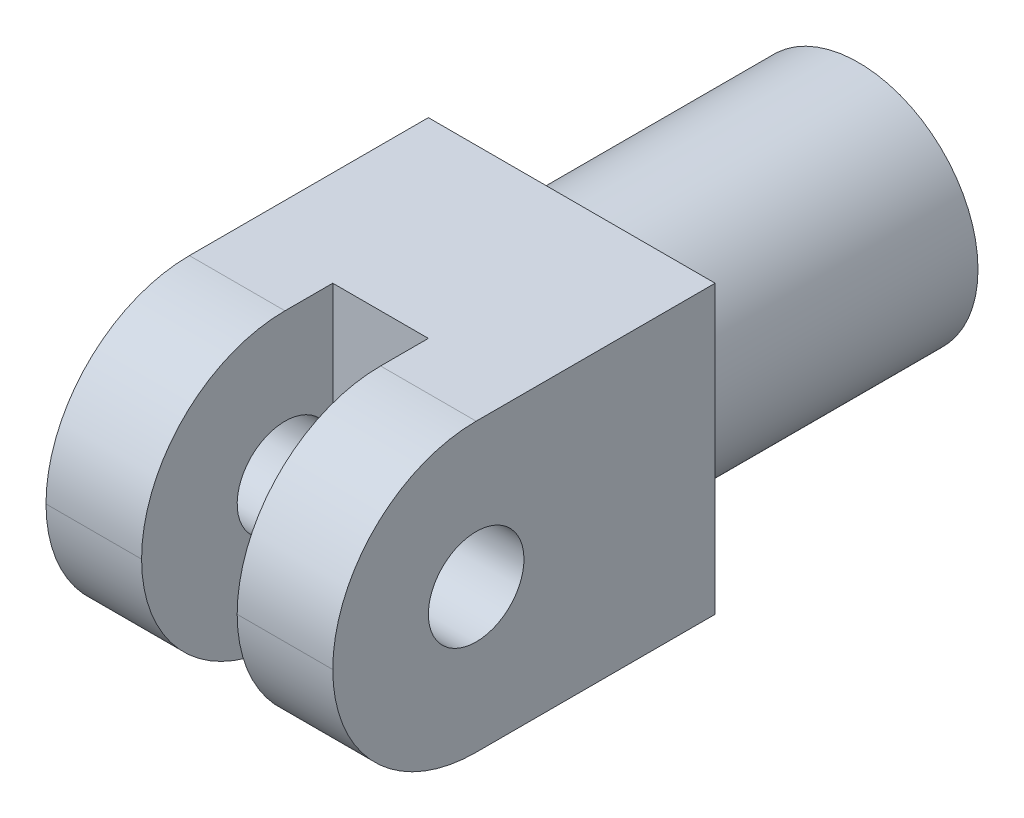
ISO-10303-21;
HEADER;
FILE_DESCRIPTION(('STEP AP214'),'2;1');
FILE_NAME('part.step','',(''),(''),'','','');
FILE_SCHEMA(('AUTOMOTIVE_DESIGN { 1 0 10303 214 1 1 1 1 }'));
ENDSEC;
DATA;
#1=APPLICATION_CONTEXT('core data for automotive mechanical design processes');
#2=APPLICATION_PROTOCOL_DEFINITION('international standard','automotive_design',2000,#1);
#3=PRODUCT_CONTEXT('',#1,'mechanical');
#4=PRODUCT('Part','Part','',(#3));
#5=PRODUCT_RELATED_PRODUCT_CATEGORY('part','',(#4));
#6=PRODUCT_DEFINITION_FORMATION('','',#4);
#7=PRODUCT_DEFINITION_CONTEXT('part definition',#1,'design');
#8=PRODUCT_DEFINITION('design','',#6,#7);
#9=PRODUCT_DEFINITION_SHAPE('','',#8);
#10=(LENGTH_UNIT() NAMED_UNIT(*) SI_UNIT(.MILLI.,.METRE.));
#11=(NAMED_UNIT(*) PLANE_ANGLE_UNIT() SI_UNIT($,.RADIAN.));
#12=(NAMED_UNIT(*) SI_UNIT($,.STERADIAN.) SOLID_ANGLE_UNIT());
#13=UNCERTAINTY_MEASURE_WITH_UNIT(LENGTH_MEASURE(1.E-05),#10,'distance_accuracy_value','');
#14=(GEOMETRIC_REPRESENTATION_CONTEXT(3) GLOBAL_UNCERTAINTY_ASSIGNED_CONTEXT((#13)) GLOBAL_UNIT_ASSIGNED_CONTEXT((#10,
#11,#12)) REPRESENTATION_CONTEXT('',''));
#15=CARTESIAN_POINT('',(0.,0.,0.));
#16=DIRECTION('',(0.,0.,1.));
#17=DIRECTION('',(1.,0.,0.));
#18=AXIS2_PLACEMENT_3D('',#15,#16,#17);
#19=CARTESIAN_POINT('',(0.,0.,30.));
#20=DIRECTION('',(0.,0.,-1.));
#21=DIRECTION('',(-1.,0.,0.));
#22=AXIS2_PLACEMENT_3D('',#19,#20,#21);
#23=CYLINDRICAL_SURFACE('',#22,12.5);
#24=CARTESIAN_POINT('',(0.,0.,30.));
#25=DIRECTION('',(0.,0.,1.));
#26=DIRECTION('',(1.,0.,0.));
#27=AXIS2_PLACEMENT_3D('',#24,#25,#26);
#28=CIRCLE('',#27,12.5);
#29=CARTESIAN_POINT('',(12.5,0.,30.));
#30=VERTEX_POINT('',#29);
#31=EDGE_CURVE('E174',#30,#30,#28,.T.);
#32=ORIENTED_EDGE('',*,*,#31,.F.);
#33=EDGE_LOOP('',(#32));
#34=FACE_BOUND('',#33,.T.);
#35=CARTESIAN_POINT('',(0.,0.,0.));
#36=DIRECTION('',(0.,0.,1.));
#37=DIRECTION('',(1.,0.,0.));
#38=AXIS2_PLACEMENT_3D('',#35,#36,#37);
#39=CIRCLE('',#38,12.5);
#40=CARTESIAN_POINT('',(12.5,0.,0.));
#41=VERTEX_POINT('',#40);
#42=EDGE_CURVE('E173',#41,#41,#39,.T.);
#43=ORIENTED_EDGE('',*,*,#42,.T.);
#44=EDGE_LOOP('',(#43));
#45=FACE_BOUND('',#44,.T.);
#46=ADVANCED_FACE('F33',(#34,#45),#23,.T.);
#47=CARTESIAN_POINT('',(0.,0.,0.));
#48=DIRECTION('',(0.,0.,1.));
#49=DIRECTION('',(1.,0.,0.));
#50=AXIS2_PLACEMENT_3D('',#47,#48,#49);
#51=PLANE('',#50);
#52=ORIENTED_EDGE('',*,*,#42,.F.);
#53=EDGE_LOOP('',(#52));
#54=FACE_BOUND('',#53,.T.);
#55=ADVANCED_FACE('F263',(#54),#51,.F.);
#56=CARTESIAN_POINT('',(15.,15.,70.));
#57=DIRECTION('',(-1.,0.,0.));
#58=DIRECTION('',(0.,-1.,0.));
#59=AXIS2_PLACEMENT_3D('',#56,#57,#58);
#60=PLANE('',#59);
#61=CARTESIAN_POINT('',(15.,0.,55.));
#62=DIRECTION('',(-1.,0.,0.));
#63=DIRECTION('',(0.,-1.,0.));
#64=AXIS2_PLACEMENT_3D('',#61,#62,#63);
#65=CIRCLE('',#64,5.);
#66=CARTESIAN_POINT('',(15.,-4.99999999999999,55.));
#67=VERTEX_POINT('',#66);
#68=EDGE_CURVE('E206',#67,#67,#65,.T.);
#69=ORIENTED_EDGE('',*,*,#68,.T.);
#70=EDGE_LOOP('',(#69));
#71=FACE_BOUND('',#70,.T.);
#72=DIRECTION('',(0.,0.,-1.));
#73=VECTOR('',#72,1.);
#74=CARTESIAN_POINT('',(15.,15.,70.));
#75=LINE('',#74,#73);
#76=CARTESIAN_POINT('',(15.,15.,55.));
#77=VERTEX_POINT('',#76);
#78=CARTESIAN_POINT('',(15.,15.,30.));
#79=VERTEX_POINT('',#78);
#80=EDGE_CURVE('E171',#77,#79,#75,.T.);
#81=ORIENTED_EDGE('',*,*,#80,.F.);
#82=CARTESIAN_POINT('',(15.,0.,55.));
#83=DIRECTION('',(-1.,0.,0.));
#84=DIRECTION('',(0.,-1.,0.));
#85=AXIS2_PLACEMENT_3D('',#82,#83,#84);
#86=CIRCLE('',#85,15.);
#87=CARTESIAN_POINT('',(15.,0.,70.));
#88=VERTEX_POINT('',#87);
#89=EDGE_CURVE('E191',#77,#88,#86,.F.);
#90=ORIENTED_EDGE('',*,*,#89,.T.);
#91=CARTESIAN_POINT('',(15.,0.,55.));
#92=DIRECTION('',(-1.,0.,0.));
#93=DIRECTION('',(0.,-1.,0.));
#94=AXIS2_PLACEMENT_3D('',#91,#92,#93);
#95=CIRCLE('',#94,15.);
#96=CARTESIAN_POINT('',(15.,-15.,55.));
#97=VERTEX_POINT('',#96);
#98=EDGE_CURVE('E189',#88,#97,#95,.F.);
#99=ORIENTED_EDGE('',*,*,#98,.T.);
#100=DIRECTION('',(0.,0.,-1.));
#101=VECTOR('',#100,1.);
#102=CARTESIAN_POINT('',(15.,-15.,70.));
#103=LINE('',#102,#101);
#104=CARTESIAN_POINT('',(15.,-15.,30.));
#105=VERTEX_POINT('',#104);
#106=EDGE_CURVE('E165',#97,#105,#103,.T.);
#107=ORIENTED_EDGE('',*,*,#106,.T.);
#108=DIRECTION('',(0.,1.,0.));
#109=VECTOR('',#108,1.);
#110=CARTESIAN_POINT('',(15.,15.,30.));
#111=LINE('',#110,#109);
#112=EDGE_CURVE('E153',#105,#79,#111,.T.);
#113=ORIENTED_EDGE('',*,*,#112,.T.);
#114=EDGE_LOOP('',(#81,#90,#99,#107,#113));
#115=FACE_BOUND('',#114,.T.);
#116=ADVANCED_FACE('F232',(#71,#115),#60,.F.);
#117=CARTESIAN_POINT('',(-15.,15.,70.));
#118=DIRECTION('',(0.,-1.,0.));
#119=DIRECTION('',(0.,0.,-1.));
#120=AXIS2_PLACEMENT_3D('',#117,#118,#119);
#121=PLANE('',#120);
#122=DIRECTION('',(0.,0.,-1.));
#123=VECTOR('',#122,1.);
#124=CARTESIAN_POINT('',(5.,15.,70.));
#125=LINE('',#124,#123);
#126=CARTESIAN_POINT('',(5.,15.,55.));
#127=VERTEX_POINT('',#126);
#128=CARTESIAN_POINT('',(5.,15.,50.));
#129=VERTEX_POINT('',#128);
#130=EDGE_CURVE('E129',#127,#129,#125,.T.);
#131=ORIENTED_EDGE('',*,*,#130,.F.);
#132=DIRECTION('',(-1.,0.,0.));
#133=VECTOR('',#132,1.);
#134=CARTESIAN_POINT('',(15.,15.,55.));
#135=LINE('',#134,#133);
#136=EDGE_CURVE('E187',#127,#77,#135,.F.);
#137=ORIENTED_EDGE('',*,*,#136,.T.);
#138=ORIENTED_EDGE('',*,*,#80,.T.);
#139=DIRECTION('',(-1.,0.,0.));
#140=VECTOR('',#139,1.);
#141=CARTESIAN_POINT('',(-15.,15.,30.));
#142=LINE('',#141,#140);
#143=CARTESIAN_POINT('',(-15.,15.,30.));
#144=VERTEX_POINT('',#143);
#145=EDGE_CURVE('E156',#79,#144,#142,.T.);
#146=ORIENTED_EDGE('',*,*,#145,.T.);
#147=DIRECTION('',(0.,0.,-1.));
#148=VECTOR('',#147,1.);
#149=CARTESIAN_POINT('',(-15.,15.,70.));
#150=LINE('',#149,#148);
#151=CARTESIAN_POINT('',(-15.,15.,55.));
#152=VERTEX_POINT('',#151);
#153=EDGE_CURVE('E169',#152,#144,#150,.T.);
#154=ORIENTED_EDGE('',*,*,#153,.F.);
#155=DIRECTION('',(-1.,0.,0.));
#156=VECTOR('',#155,1.);
#157=CARTESIAN_POINT('',(-4.99999999999999,15.,55.));
#158=LINE('',#157,#156);
#159=CARTESIAN_POINT('',(-5.,15.,55.));
#160=VERTEX_POINT('',#159);
#161=EDGE_CURVE('E185',#152,#160,#158,.F.);
#162=ORIENTED_EDGE('',*,*,#161,.T.);
#163=DIRECTION('',(0.,0.,1.));
#164=VECTOR('',#163,1.);
#165=CARTESIAN_POINT('',(-5.,15.,50.));
#166=LINE('',#165,#164);
#167=CARTESIAN_POINT('',(-5.,15.,50.));
#168=VERTEX_POINT('',#167);
#169=EDGE_CURVE('E126',#168,#160,#166,.T.);
#170=ORIENTED_EDGE('',*,*,#169,.F.);
#171=DIRECTION('',(-1.,0.,0.));
#172=VECTOR('',#171,1.);
#173=CARTESIAN_POINT('',(5.,15.,50.));
#174=LINE('',#173,#172);
#175=EDGE_CURVE('E120',#129,#168,#174,.T.);
#176=ORIENTED_EDGE('',*,*,#175,.F.);
#177=EDGE_LOOP('',(#131,#137,#138,#146,#154,#162,#170,#176));
#178=FACE_BOUND('',#177,.T.);
#179=ADVANCED_FACE('F138',(#178),#121,.F.);
#180=CARTESIAN_POINT('',(-15.,15.,70.));
#181=DIRECTION('',(1.,0.,0.));
#182=DIRECTION('',(0.,1.,0.));
#183=AXIS2_PLACEMENT_3D('',#180,#181,#182);
#184=PLANE('',#183);
#185=CARTESIAN_POINT('',(-15.,0.,55.));
#186=DIRECTION('',(-1.,0.,0.));
#187=DIRECTION('',(0.,-1.,0.));
#188=AXIS2_PLACEMENT_3D('',#185,#186,#187);
#189=CIRCLE('',#188,5.);
#190=CARTESIAN_POINT('',(-15.,-5.,55.));
#191=VERTEX_POINT('',#190);
#192=EDGE_CURVE('E215',#191,#191,#189,.T.);
#193=ORIENTED_EDGE('',*,*,#192,.F.);
#194=EDGE_LOOP('',(#193));
#195=FACE_BOUND('',#194,.T.);
#196=DIRECTION('',(0.,0.,-1.));
#197=VECTOR('',#196,1.);
#198=CARTESIAN_POINT('',(-15.,-15.,70.));
#199=LINE('',#198,#197);
#200=CARTESIAN_POINT('',(-15.,-15.,55.));
#201=VERTEX_POINT('',#200);
#202=CARTESIAN_POINT('',(-15.,-15.,30.));
#203=VERTEX_POINT('',#202);
#204=EDGE_CURVE('E167',#201,#203,#199,.T.);
#205=ORIENTED_EDGE('',*,*,#204,.F.);
#206=CARTESIAN_POINT('',(-15.,0.,55.));
#207=DIRECTION('',(1.,0.,0.));
#208=DIRECTION('',(0.,1.,0.));
#209=AXIS2_PLACEMENT_3D('',#206,#207,#208);
#210=CIRCLE('',#209,15.);
#211=CARTESIAN_POINT('',(-15.,0.,70.));
#212=VERTEX_POINT('',#211);
#213=EDGE_CURVE('E11',#201,#212,#210,.F.);
#214=ORIENTED_EDGE('',*,*,#213,.T.);
#215=CARTESIAN_POINT('',(-15.,0.,55.));
#216=DIRECTION('',(1.,0.,0.));
#217=DIRECTION('',(0.,1.,0.));
#218=AXIS2_PLACEMENT_3D('',#215,#216,#217);
#219=CIRCLE('',#218,15.);
#220=EDGE_CURVE('E42',#212,#152,#219,.F.);
#221=ORIENTED_EDGE('',*,*,#220,.T.);
#222=ORIENTED_EDGE('',*,*,#153,.T.);
#223=DIRECTION('',(0.,-1.,0.));
#224=VECTOR('',#223,1.);
#225=CARTESIAN_POINT('',(-15.,15.,30.));
#226=LINE('',#225,#224);
#227=EDGE_CURVE('E159',#144,#203,#226,.T.);
#228=ORIENTED_EDGE('',*,*,#227,.T.);
#229=EDGE_LOOP('',(#205,#214,#221,#222,#228));
#230=FACE_BOUND('',#229,.T.);
#231=ADVANCED_FACE('F252',(#195,#230),#184,.F.);
#232=CARTESIAN_POINT('',(-15.,-15.,70.));
#233=DIRECTION('',(0.,1.,0.));
#234=DIRECTION('',(0.,0.,1.));
#235=AXIS2_PLACEMENT_3D('',#232,#233,#234);
#236=PLANE('',#235);
#237=ORIENTED_EDGE('',*,*,#106,.F.);
#238=DIRECTION('',(1.,0.,0.));
#239=VECTOR('',#238,1.);
#240=CARTESIAN_POINT('',(5.,-15.,55.));
#241=LINE('',#240,#239);
#242=CARTESIAN_POINT('',(5.,-15.,55.));
#243=VERTEX_POINT('',#242);
#244=EDGE_CURVE('E196',#97,#243,#241,.F.);
#245=ORIENTED_EDGE('',*,*,#244,.T.);
#246=DIRECTION('',(0.,0.,-1.));
#247=VECTOR('',#246,1.);
#248=CARTESIAN_POINT('',(5.,-15.,70.));
#249=LINE('',#248,#247);
#250=CARTESIAN_POINT('',(5.,-15.,50.));
#251=VERTEX_POINT('',#250);
#252=EDGE_CURVE('E146',#243,#251,#249,.T.);
#253=ORIENTED_EDGE('',*,*,#252,.T.);
#254=DIRECTION('',(-1.,0.,0.));
#255=VECTOR('',#254,1.);
#256=CARTESIAN_POINT('',(-15.,-15.,50.));
#257=LINE('',#256,#255);
#258=CARTESIAN_POINT('',(-5.,-15.,50.));
#259=VERTEX_POINT('',#258);
#260=EDGE_CURVE('E177',#251,#259,#257,.T.);
#261=ORIENTED_EDGE('',*,*,#260,.T.);
#262=DIRECTION('',(0.,0.,1.));
#263=VECTOR('',#262,1.);
#264=CARTESIAN_POINT('',(-4.99999999999999,-15.,70.));
#265=LINE('',#264,#263);
#266=CARTESIAN_POINT('',(-5.,-15.,55.));
#267=VERTEX_POINT('',#266);
#268=EDGE_CURVE('E150',#259,#267,#265,.T.);
#269=ORIENTED_EDGE('',*,*,#268,.T.);
#270=DIRECTION('',(1.,0.,0.));
#271=VECTOR('',#270,1.);
#272=CARTESIAN_POINT('',(-15.,-15.,55.));
#273=LINE('',#272,#271);
#274=EDGE_CURVE('E193',#267,#201,#273,.F.);
#275=ORIENTED_EDGE('',*,*,#274,.T.);
#276=ORIENTED_EDGE('',*,*,#204,.T.);
#277=DIRECTION('',(1.,0.,0.));
#278=VECTOR('',#277,1.);
#279=CARTESIAN_POINT('',(-15.,-15.,30.));
#280=LINE('',#279,#278);
#281=EDGE_CURVE('E162',#203,#105,#280,.T.);
#282=ORIENTED_EDGE('',*,*,#281,.T.);
#283=EDGE_LOOP('',(#237,#245,#253,#261,#269,#275,#276,#282));
#284=FACE_BOUND('',#283,.T.);
#285=ADVANCED_FACE('F249',(#284),#236,.F.);
#286=CARTESIAN_POINT('',(0.,0.,30.));
#287=DIRECTION('',(0.,0.,1.));
#288=DIRECTION('',(1.,0.,0.));
#289=AXIS2_PLACEMENT_3D('',#286,#287,#288);
#290=PLANE('',#289);
#291=ORIENTED_EDGE('',*,*,#31,.T.);
#292=EDGE_LOOP('',(#291));
#293=FACE_BOUND('',#292,.T.);
#294=ORIENTED_EDGE('',*,*,#112,.F.);
#295=ORIENTED_EDGE('',*,*,#281,.F.);
#296=ORIENTED_EDGE('',*,*,#227,.F.);
#297=ORIENTED_EDGE('',*,*,#145,.F.);
#298=EDGE_LOOP('',(#294,#295,#296,#297));
#299=FACE_BOUND('',#298,.T.);
#300=ADVANCED_FACE('F237',(#293,#299),#290,.F.);
#301=CARTESIAN_POINT('',(5.,-25.,50.));
#302=DIRECTION('',(0.,0.,-1.));
#303=DIRECTION('',(-1.,0.,0.));
#304=AXIS2_PLACEMENT_3D('',#301,#302,#303);
#305=PLANE('',#304);
#306=DIRECTION('',(0.,1.,0.));
#307=VECTOR('',#306,1.);
#308=CARTESIAN_POINT('',(5.,-25.,50.));
#309=LINE('',#308,#307);
#310=CARTESIAN_POINT('',(5.,0.,50.));
#311=VERTEX_POINT('',#310);
#312=EDGE_CURVE('E124',#251,#311,#309,.T.);
#313=ORIENTED_EDGE('',*,*,#312,.T.);
#314=EDGE_CURVE('E115',#311,#129,#309,.T.);
#315=ORIENTED_EDGE('',*,*,#314,.T.);
#316=ORIENTED_EDGE('',*,*,#175,.T.);
#317=DIRECTION('',(0.,1.,0.));
#318=VECTOR('',#317,1.);
#319=CARTESIAN_POINT('',(-5.,-25.,50.));
#320=LINE('',#319,#318);
#321=CARTESIAN_POINT('',(-5.,0.,50.));
#322=VERTEX_POINT('',#321);
#323=EDGE_CURVE('E147',#322,#168,#320,.T.);
#324=ORIENTED_EDGE('',*,*,#323,.F.);
#325=EDGE_CURVE('E144',#259,#322,#320,.T.);
#326=ORIENTED_EDGE('',*,*,#325,.F.);
#327=ORIENTED_EDGE('',*,*,#260,.F.);
#328=EDGE_LOOP('',(#313,#315,#316,#324,#326,#327));
#329=FACE_BOUND('',#328,.T.);
#330=ADVANCED_FACE('F117',(#329),#305,.F.);
#331=CARTESIAN_POINT('',(-5.,-25.,50.));
#332=DIRECTION('',(-1.,0.,0.));
#333=DIRECTION('',(0.,0.,1.));
#334=AXIS2_PLACEMENT_3D('',#331,#332,#333);
#335=PLANE('',#334);
#336=ORIENTED_EDGE('',*,*,#325,.T.);
#337=CARTESIAN_POINT('',(-5.,0.,55.));
#338=DIRECTION('',(-1.,0.,0.));
#339=DIRECTION('',(0.,0.,1.));
#340=AXIS2_PLACEMENT_3D('',#337,#338,#339);
#341=CIRCLE('',#340,5.);
#342=EDGE_CURVE('E48',#322,#322,#341,.T.);
#343=ORIENTED_EDGE('',*,*,#342,.T.);
#344=ORIENTED_EDGE('',*,*,#323,.T.);
#345=ORIENTED_EDGE('',*,*,#169,.T.);
#346=CARTESIAN_POINT('',(-5.,0.,55.));
#347=DIRECTION('',(-1.,0.,0.));
#348=DIRECTION('',(0.,0.,1.));
#349=AXIS2_PLACEMENT_3D('',#346,#347,#348);
#350=CIRCLE('',#349,15.);
#351=CARTESIAN_POINT('',(-4.99999999999999,0.,70.));
#352=VERTEX_POINT('',#351);
#353=EDGE_CURVE('E198',#160,#352,#350,.F.);
#354=ORIENTED_EDGE('',*,*,#353,.T.);
#355=CARTESIAN_POINT('',(-5.,0.,55.));
#356=DIRECTION('',(-1.,0.,0.));
#357=DIRECTION('',(0.,0.,1.));
#358=AXIS2_PLACEMENT_3D('',#355,#356,#357);
#359=CIRCLE('',#358,15.);
#360=EDGE_CURVE('E200',#352,#267,#359,.F.);
#361=ORIENTED_EDGE('',*,*,#360,.T.);
#362=ORIENTED_EDGE('',*,*,#268,.F.);
#363=EDGE_LOOP('',(#336,#343,#344,#345,#354,#361,#362));
#364=FACE_BOUND('',#363,.T.);
#365=ADVANCED_FACE('F246',(#364),#335,.F.);
#366=CARTESIAN_POINT('',(5.,-25.,70.));
#367=DIRECTION('',(1.,0.,0.));
#368=DIRECTION('',(0.,0.,-1.));
#369=AXIS2_PLACEMENT_3D('',#366,#367,#368);
#370=PLANE('',#369);
#371=ORIENTED_EDGE('',*,*,#314,.F.);
#372=CARTESIAN_POINT('',(5.,0.,55.));
#373=DIRECTION('',(1.,0.,0.));
#374=DIRECTION('',(0.,0.,-1.));
#375=AXIS2_PLACEMENT_3D('',#372,#373,#374);
#376=CIRCLE('',#375,5.);
#377=EDGE_CURVE('E37',#311,#311,#376,.T.);
#378=ORIENTED_EDGE('',*,*,#377,.T.);
#379=ORIENTED_EDGE('',*,*,#312,.F.);
#380=ORIENTED_EDGE('',*,*,#252,.F.);
#381=CARTESIAN_POINT('',(5.,0.,55.));
#382=DIRECTION('',(1.,0.,0.));
#383=DIRECTION('',(0.,0.,-1.));
#384=AXIS2_PLACEMENT_3D('',#381,#382,#383);
#385=CIRCLE('',#384,15.);
#386=CARTESIAN_POINT('',(5.,0.,70.));
#387=VERTEX_POINT('',#386);
#388=EDGE_CURVE('E182',#243,#387,#385,.F.);
#389=ORIENTED_EDGE('',*,*,#388,.T.);
#390=CARTESIAN_POINT('',(5.,0.,55.));
#391=DIRECTION('',(1.,0.,0.));
#392=DIRECTION('',(0.,0.,-1.));
#393=AXIS2_PLACEMENT_3D('',#390,#391,#392);
#394=CIRCLE('',#393,15.);
#395=EDGE_CURVE('E132',#387,#127,#394,.F.);
#396=ORIENTED_EDGE('',*,*,#395,.T.);
#397=ORIENTED_EDGE('',*,*,#130,.T.);
#398=EDGE_LOOP('',(#371,#378,#379,#380,#389,#396,#397));
#399=FACE_BOUND('',#398,.T.);
#400=ADVANCED_FACE('F130',(#399),#370,.F.);
#401=CARTESIAN_POINT('',(0.,0.,55.));
#402=DIRECTION('',(-1.,0.,0.));
#403=DIRECTION('',(0.,0.,1.));
#404=AXIS2_PLACEMENT_3D('',#401,#402,#403);
#405=CYLINDRICAL_SURFACE('',#404,15.);
#406=ORIENTED_EDGE('',*,*,#244,.F.);
#407=ORIENTED_EDGE('',*,*,#98,.F.);
#408=DIRECTION('',(1.,0.,0.));
#409=VECTOR('',#408,1.);
#410=CARTESIAN_POINT('',(15.,0.,70.));
#411=LINE('',#410,#409);
#412=EDGE_CURVE('E136',#387,#88,#411,.T.);
#413=ORIENTED_EDGE('',*,*,#412,.F.);
#414=ORIENTED_EDGE('',*,*,#388,.F.);
#415=EDGE_LOOP('',(#406,#407,#413,#414));
#416=FACE_BOUND('',#415,.T.);
#417=ADVANCED_FACE('F225',(#416),#405,.T.);
#418=CARTESIAN_POINT('',(0.,0.,55.));
#419=DIRECTION('',(1.,0.,0.));
#420=DIRECTION('',(0.,0.,-1.));
#421=AXIS2_PLACEMENT_3D('',#418,#419,#420);
#422=CYLINDRICAL_SURFACE('',#421,15.);
#423=ORIENTED_EDGE('',*,*,#89,.F.);
#424=ORIENTED_EDGE('',*,*,#136,.F.);
#425=ORIENTED_EDGE('',*,*,#395,.F.);
#426=ORIENTED_EDGE('',*,*,#412,.T.);
#427=EDGE_LOOP('',(#423,#424,#425,#426));
#428=FACE_BOUND('',#427,.T.);
#429=ADVANCED_FACE('F228',(#428),#422,.T.);
#430=CARTESIAN_POINT('',(0.,0.,55.));
#431=DIRECTION('',(1.,0.,0.));
#432=DIRECTION('',(0.,0.,-1.));
#433=AXIS2_PLACEMENT_3D('',#430,#431,#432);
#434=CYLINDRICAL_SURFACE('',#433,15.);
#435=ORIENTED_EDGE('',*,*,#161,.F.);
#436=ORIENTED_EDGE('',*,*,#220,.F.);
#437=DIRECTION('',(-1.,0.,0.));
#438=VECTOR('',#437,1.);
#439=CARTESIAN_POINT('',(-15.,0.,70.));
#440=LINE('',#439,#438);
#441=EDGE_CURVE('E204',#352,#212,#440,.T.);
#442=ORIENTED_EDGE('',*,*,#441,.F.);
#443=ORIENTED_EDGE('',*,*,#353,.F.);
#444=EDGE_LOOP('',(#435,#436,#442,#443));
#445=FACE_BOUND('',#444,.T.);
#446=ADVANCED_FACE('F35',(#445),#434,.T.);
#447=CARTESIAN_POINT('',(0.,0.,55.));
#448=DIRECTION('',(-1.,0.,0.));
#449=DIRECTION('',(0.,0.,1.));
#450=AXIS2_PLACEMENT_3D('',#447,#448,#449);
#451=CYLINDRICAL_SURFACE('',#450,15.);
#452=ORIENTED_EDGE('',*,*,#213,.F.);
#453=ORIENTED_EDGE('',*,*,#274,.F.);
#454=ORIENTED_EDGE('',*,*,#360,.F.);
#455=ORIENTED_EDGE('',*,*,#441,.T.);
#456=EDGE_LOOP('',(#452,#453,#454,#455));
#457=FACE_BOUND('',#456,.T.);
#458=ADVANCED_FACE('F251',(#457),#451,.T.);
#459=CARTESIAN_POINT('',(25.,0.,55.));
#460=DIRECTION('',(-1.,0.,0.));
#461=DIRECTION('',(0.,-1.,0.));
#462=AXIS2_PLACEMENT_3D('',#459,#460,#461);
#463=CYLINDRICAL_SURFACE('',#462,5.);
#464=ORIENTED_EDGE('',*,*,#377,.F.);
#465=EDGE_LOOP('',(#464));
#466=FACE_BOUND('',#465,.T.);
#467=ORIENTED_EDGE('',*,*,#68,.F.);
#468=EDGE_LOOP('',(#467));
#469=FACE_BOUND('',#468,.T.);
#470=ADVANCED_FACE('F279',(#466,#469),#463,.F.);
#471=ORIENTED_EDGE('',*,*,#192,.T.);
#472=EDGE_LOOP('',(#471));
#473=FACE_BOUND('',#472,.T.);
#474=ORIENTED_EDGE('',*,*,#342,.F.);
#475=EDGE_LOOP('',(#474));
#476=FACE_BOUND('',#475,.T.);
#477=ADVANCED_FACE('F284',(#473,#476),#463,.F.);
#478=CLOSED_SHELL('',(#46,#55,#116,#179,#231,#285,#300,#330,#365,#400,#417,#429,#446,#458,#470,#477));
#479=MANIFOLD_SOLID_BREP('B2',#478);
#480=ADVANCED_BREP_SHAPE_REPRESENTATION('',(#18,#479),#14);
#481=SHAPE_DEFINITION_REPRESENTATION(#9,#480);
ENDSEC;
END-ISO-10303-21;
